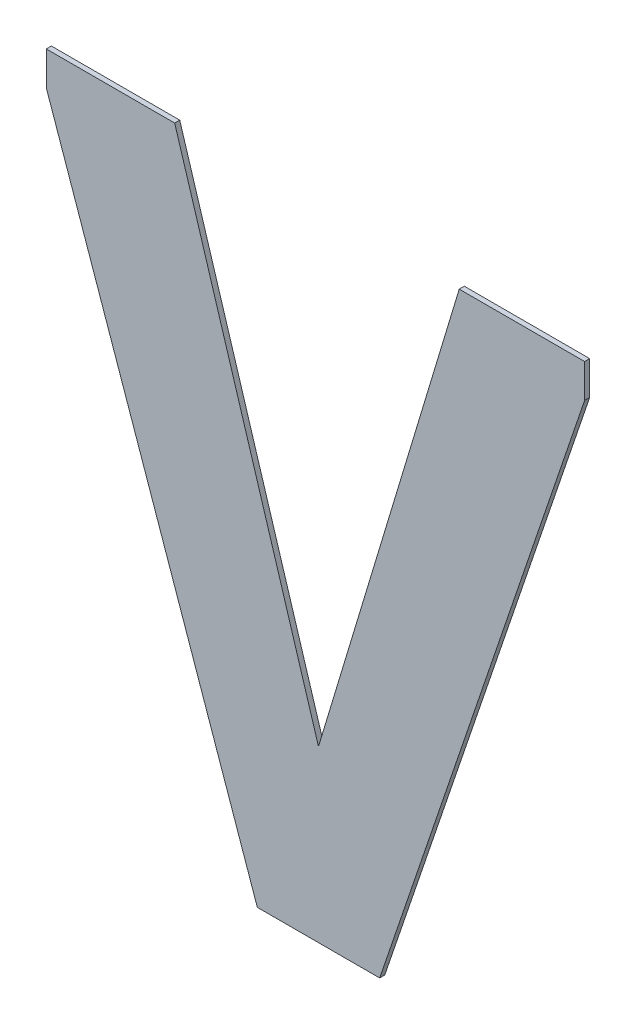
ISO-10303-21;
HEADER;
FILE_DESCRIPTION(('STEP AP214'),'2;1');
FILE_NAME('part.step','',(''),(''),'','','');
FILE_SCHEMA(('AUTOMOTIVE_DESIGN { 1 0 10303 214 1 1 1 1 }'));
ENDSEC;
DATA;
#1=APPLICATION_CONTEXT('core data for automotive mechanical design processes');
#2=APPLICATION_PROTOCOL_DEFINITION('international standard','automotive_design',2000,#1);
#3=PRODUCT_CONTEXT('',#1,'mechanical');
#4=PRODUCT('Part','Part','',(#3));
#5=PRODUCT_RELATED_PRODUCT_CATEGORY('part','',(#4));
#6=PRODUCT_DEFINITION_FORMATION('','',#4);
#7=PRODUCT_DEFINITION_CONTEXT('part definition',#1,'design');
#8=PRODUCT_DEFINITION('design','',#6,#7);
#9=PRODUCT_DEFINITION_SHAPE('','',#8);
#10=(LENGTH_UNIT() NAMED_UNIT(*) SI_UNIT(.MILLI.,.METRE.));
#11=(NAMED_UNIT(*) PLANE_ANGLE_UNIT() SI_UNIT($,.RADIAN.));
#12=(NAMED_UNIT(*) SI_UNIT($,.STERADIAN.) SOLID_ANGLE_UNIT());
#13=UNCERTAINTY_MEASURE_WITH_UNIT(LENGTH_MEASURE(1.E-05),#10,'distance_accuracy_value','');
#14=(GEOMETRIC_REPRESENTATION_CONTEXT(3) GLOBAL_UNCERTAINTY_ASSIGNED_CONTEXT((#13)) GLOBAL_UNIT_ASSIGNED_CONTEXT((#10,
#11,#12)) REPRESENTATION_CONTEXT('',''));
#15=CARTESIAN_POINT('',(0.,0.,0.));
#16=DIRECTION('',(0.,0.,1.));
#17=DIRECTION('',(1.,0.,0.));
#18=AXIS2_PLACEMENT_3D('',#15,#16,#17);
#19=CARTESIAN_POINT('',(-0.5146307591557,-0.1540642016862,0.00086146168299));
#20=DIRECTION('',(0.,-1.,0.));
#21=DIRECTION('',(0.,0.,-1.));
#22=AXIS2_PLACEMENT_3D('',#19,#20,#21);
#23=PLANE('',#22);
#24=DIRECTION('',(0.,0.,1.));
#25=VECTOR('',#24,1.);
#26=CARTESIAN_POINT('',(-0.5001531659177,-0.1540642016862,-0.00033853831701));
#27=LINE('',#26,#25);
#28=CARTESIAN_POINT('',(-0.5001531659177,-0.1540642016862,-0.00033853831701));
#29=VERTEX_POINT('',#28);
#30=CARTESIAN_POINT('',(-0.5001531659177,-0.1540642016862,0.00086146168299));
#31=VERTEX_POINT('',#30);
#32=EDGE_CURVE('E11',#29,#31,#27,.T.);
#33=ORIENTED_EDGE('',*,*,#32,.T.);
#34=DIRECTION('',(-1.,0.,0.));
#35=VECTOR('',#34,1.);
#36=CARTESIAN_POINT('',(-0.5001531659177,-0.1540642016862,0.00086146168299));
#37=LINE('',#36,#35);
#38=CARTESIAN_POINT('',(-0.5291083523937,-0.1540642016862,0.00086146168299));
#39=VERTEX_POINT('',#38);
#40=EDGE_CURVE('E24',#31,#39,#37,.T.);
#41=ORIENTED_EDGE('',*,*,#40,.T.);
#42=DIRECTION('',(0.,0.,1.));
#43=VECTOR('',#42,1.);
#44=CARTESIAN_POINT('',(-0.5291083523937,-0.1540642016862,-0.00033853831701));
#45=LINE('',#44,#43);
#46=CARTESIAN_POINT('',(-0.5291083523937,-0.1540642016862,-0.00033853831701));
#47=VERTEX_POINT('',#46);
#48=EDGE_CURVE('E155',#47,#39,#45,.T.);
#49=ORIENTED_EDGE('',*,*,#48,.F.);
#50=DIRECTION('',(-1.,0.,0.));
#51=VECTOR('',#50,1.);
#52=CARTESIAN_POINT('',(-0.5001531659177,-0.1540642016862,-0.00033853831701));
#53=LINE('',#52,#51);
#54=EDGE_CURVE('E153',#29,#47,#53,.T.);
#55=ORIENTED_EDGE('',*,*,#54,.F.);
#56=EDGE_LOOP('',(#33,#41,#49,#55));
#57=FACE_BOUND('',#56,.T.);
#58=ADVANCED_FACE('F17',(#57),#23,.T.);
#59=CARTESIAN_POINT('',(-0.5540721491029,-0.082584404006468,0.00086146168299));
#60=DIRECTION('',(-0.944081069949815,-0.32971341095323,0.));
#61=DIRECTION('',(0.,0.,1.));
#62=AXIS2_PLACEMENT_3D('',#59,#60,#61);
#63=PLANE('',#62);
#64=ORIENTED_EDGE('',*,*,#48,.T.);
#65=DIRECTION('',(-0.32971341095323,0.944081069949815,0.));
#66=VECTOR('',#65,1.);
#67=CARTESIAN_POINT('',(-0.5291083523937,-0.1540642016862,0.00086146168299));
#68=LINE('',#67,#66);
#69=CARTESIAN_POINT('',(-0.5790359458121,-0.011104606326736,0.00086146168299));
#70=VERTEX_POINT('',#69);
#71=EDGE_CURVE('E151',#39,#70,#68,.T.);
#72=ORIENTED_EDGE('',*,*,#71,.T.);
#73=DIRECTION('',(0.,0.,1.));
#74=VECTOR('',#73,1.);
#75=CARTESIAN_POINT('',(-0.5790359458121,-0.011104606326736,-0.00033853831701));
#76=LINE('',#75,#74);
#77=CARTESIAN_POINT('',(-0.5790359458121,-0.011104606326736,-0.00033853831701));
#78=VERTEX_POINT('',#77);
#79=EDGE_CURVE('E148',#78,#70,#76,.T.);
#80=ORIENTED_EDGE('',*,*,#79,.F.);
#81=DIRECTION('',(-0.32971341095323,0.944081069949815,0.));
#82=VECTOR('',#81,1.);
#83=CARTESIAN_POINT('',(-0.5291083523937,-0.1540642016862,-0.00033853831701));
#84=LINE('',#83,#82);
#85=EDGE_CURVE('E145',#47,#78,#84,.T.);
#86=ORIENTED_EDGE('',*,*,#85,.F.);
#87=EDGE_LOOP('',(#64,#72,#80,#86));
#88=FACE_BOUND('',#87,.T.);
#89=ADVANCED_FACE('F161',(#88),#63,.T.);
#90=CARTESIAN_POINT('',(-0.5790359458121,-0.00711827398195001,0.00086146168299));
#91=DIRECTION('',(-1.,0.,0.));
#92=DIRECTION('',(0.,0.,1.));
#93=AXIS2_PLACEMENT_3D('',#90,#91,#92);
#94=PLANE('',#93);
#95=ORIENTED_EDGE('',*,*,#79,.T.);
#96=DIRECTION('',(0.,1.,0.));
#97=VECTOR('',#96,1.);
#98=CARTESIAN_POINT('',(-0.5790359458121,-0.011104606326736,0.00086146168299));
#99=LINE('',#98,#97);
#100=CARTESIAN_POINT('',(-0.5790359458121,-0.00313194163716401,0.00086146168299));
#101=VERTEX_POINT('',#100);
#102=EDGE_CURVE('E143',#70,#101,#99,.T.);
#103=ORIENTED_EDGE('',*,*,#102,.T.);
#104=DIRECTION('',(0.,0.,1.));
#105=VECTOR('',#104,1.);
#106=CARTESIAN_POINT('',(-0.5790359458121,-0.00313194163716401,-0.00033853831701));
#107=LINE('',#106,#105);
#108=CARTESIAN_POINT('',(-0.5790359458121,-0.00313194163716401,-0.00033853831701));
#109=VERTEX_POINT('',#108);
#110=EDGE_CURVE('E140',#109,#101,#107,.T.);
#111=ORIENTED_EDGE('',*,*,#110,.F.);
#112=DIRECTION('',(0.,1.,0.));
#113=VECTOR('',#112,1.);
#114=CARTESIAN_POINT('',(-0.5790359458121,-0.011104606326736,-0.00033853831701));
#115=LINE('',#114,#113);
#116=EDGE_CURVE('E137',#78,#109,#115,.T.);
#117=ORIENTED_EDGE('',*,*,#116,.F.);
#118=EDGE_LOOP('',(#95,#103,#111,#117));
#119=FACE_BOUND('',#118,.T.);
#120=ADVANCED_FACE('F167',(#119),#94,.T.);
#121=CARTESIAN_POINT('',(-0.5638467010363,-0.00313194163716401,0.00086146168299));
#122=DIRECTION('',(0.,1.,0.));
#123=DIRECTION('',(0.,0.,1.));
#124=AXIS2_PLACEMENT_3D('',#121,#122,#123);
#125=PLANE('',#124);
#126=ORIENTED_EDGE('',*,*,#110,.T.);
#127=DIRECTION('',(1.,0.,0.));
#128=VECTOR('',#127,1.);
#129=CARTESIAN_POINT('',(-0.5790359458121,-0.00313194163716401,0.00086146168299));
#130=LINE('',#129,#128);
#131=CARTESIAN_POINT('',(-0.5486574562605,-0.00313194163716401,0.00086146168299));
#132=VERTEX_POINT('',#131);
#133=EDGE_CURVE('E135',#101,#132,#130,.T.);
#134=ORIENTED_EDGE('',*,*,#133,.T.);
#135=DIRECTION('',(0.,0.,1.));
#136=VECTOR('',#135,1.);
#137=CARTESIAN_POINT('',(-0.5486574562605,-0.00313194163716401,-0.00033853831701));
#138=LINE('',#137,#136);
#139=CARTESIAN_POINT('',(-0.5486574562605,-0.00313194163716401,-0.00033853831701));
#140=VERTEX_POINT('',#139);
#141=EDGE_CURVE('E132',#140,#132,#138,.T.);
#142=ORIENTED_EDGE('',*,*,#141,.F.);
#143=DIRECTION('',(1.,0.,0.));
#144=VECTOR('',#143,1.);
#145=CARTESIAN_POINT('',(-0.5790359458121,-0.00313194163716401,-0.00033853831701));
#146=LINE('',#145,#144);
#147=EDGE_CURVE('E129',#109,#140,#146,.T.);
#148=ORIENTED_EDGE('',*,*,#147,.F.);
#149=EDGE_LOOP('',(#126,#134,#142,#148));
#150=FACE_BOUND('',#149,.T.);
#151=ADVANCED_FACE('F171',(#150),#125,.T.);
#152=CARTESIAN_POINT('',(-0.5316439270859,-0.058505294919482,0.00086146168299));
#153=DIRECTION('',(0.955897450324787,0.293700637490916,0.));
#154=DIRECTION('',(0.,0.,-1.));
#155=AXIS2_PLACEMENT_3D('',#152,#153,#154);
#156=PLANE('',#155);
#157=ORIENTED_EDGE('',*,*,#141,.T.);
#158=DIRECTION('',(0.293700637490916,-0.955897450324787,0.));
#159=VECTOR('',#158,1.);
#160=CARTESIAN_POINT('',(-0.5486574562605,-0.00313194163716401,0.00086146168299));
#161=LINE('',#160,#159);
#162=CARTESIAN_POINT('',(-0.5146303979113,-0.1138786482018,0.00086146168299));
#163=VERTEX_POINT('',#162);
#164=EDGE_CURVE('E127',#132,#163,#161,.T.);
#165=ORIENTED_EDGE('',*,*,#164,.T.);
#166=DIRECTION('',(0.,0.,1.));
#167=VECTOR('',#166,1.);
#168=CARTESIAN_POINT('',(-0.5146303979113,-0.1138786482018,-0.00033853831701));
#169=LINE('',#168,#167);
#170=CARTESIAN_POINT('',(-0.5146303979113,-0.1138786482018,-0.00033853831701));
#171=VERTEX_POINT('',#170);
#172=EDGE_CURVE('E124',#171,#163,#169,.T.);
#173=ORIENTED_EDGE('',*,*,#172,.F.);
#174=DIRECTION('',(0.293700637490916,-0.955897450324787,0.));
#175=VECTOR('',#174,1.);
#176=CARTESIAN_POINT('',(-0.5486574562605,-0.00313194163716401,-0.00033853831701));
#177=LINE('',#176,#175);
#178=EDGE_CURVE('E121',#140,#171,#177,.T.);
#179=ORIENTED_EDGE('',*,*,#178,.F.);
#180=EDGE_LOOP('',(#157,#165,#173,#179));
#181=FACE_BOUND('',#180,.T.);
#182=ADVANCED_FACE('F175',(#181),#156,.T.);
#183=CARTESIAN_POINT('',(-0.4979813643719,-0.058688807092672,0.00086146168299));
#184=DIRECTION('',(-0.957385527935417,0.288813003342687,0.));
#185=DIRECTION('',(0.,0.,1.));
#186=AXIS2_PLACEMENT_3D('',#183,#184,#185);
#187=PLANE('',#186);
#188=ORIENTED_EDGE('',*,*,#172,.T.);
#189=DIRECTION('',(0.288813003342687,0.957385527935417,0.));
#190=VECTOR('',#189,1.);
#191=CARTESIAN_POINT('',(-0.5146303979113,-0.1138786482018,0.00086146168299));
#192=LINE('',#191,#190);
#193=CARTESIAN_POINT('',(-0.4813323308325,-0.00349896598354401,0.00086146168299));
#194=VERTEX_POINT('',#193);
#195=EDGE_CURVE('E119',#163,#194,#192,.T.);
#196=ORIENTED_EDGE('',*,*,#195,.T.);
#197=DIRECTION('',(0.,0.,1.));
#198=VECTOR('',#197,1.);
#199=CARTESIAN_POINT('',(-0.4813323308325,-0.00349896598354401,-0.00033853831701));
#200=LINE('',#199,#198);
#201=CARTESIAN_POINT('',(-0.4813323308325,-0.00349896598354401,-0.00033853831701));
#202=VERTEX_POINT('',#201);
#203=EDGE_CURVE('E116',#202,#194,#200,.T.);
#204=ORIENTED_EDGE('',*,*,#203,.F.);
#205=DIRECTION('',(0.288813003342687,0.957385527935417,0.));
#206=VECTOR('',#205,1.);
#207=CARTESIAN_POINT('',(-0.5146303979113,-0.1138786482018,-0.00033853831701));
#208=LINE('',#207,#206);
#209=EDGE_CURVE('E114',#171,#202,#208,.T.);
#210=ORIENTED_EDGE('',*,*,#209,.F.);
#211=EDGE_LOOP('',(#188,#196,#204,#210));
#212=FACE_BOUND('',#211,.T.);
#213=ADVANCED_FACE('F178',(#212),#187,.T.);
#214=CARTESIAN_POINT('',(-0.4664960218701,-0.00349896598354401,0.00086146168299));
#215=DIRECTION('',(0.,1.,0.));
#216=DIRECTION('',(0.,0.,1.));
#217=AXIS2_PLACEMENT_3D('',#214,#215,#216);
#218=PLANE('',#217);
#219=ORIENTED_EDGE('',*,*,#203,.T.);
#220=DIRECTION('',(1.,0.,0.));
#221=VECTOR('',#220,1.);
#222=CARTESIAN_POINT('',(-0.4813323308325,-0.00349896598354401,0.00086146168299));
#223=LINE('',#222,#221);
#224=CARTESIAN_POINT('',(-0.4516597129077,-0.00349896598354401,0.00086146168299));
#225=VERTEX_POINT('',#224);
#226=EDGE_CURVE('E112',#194,#225,#223,.T.);
#227=ORIENTED_EDGE('',*,*,#226,.T.);
#228=DIRECTION('',(0.,0.,1.));
#229=VECTOR('',#228,1.);
#230=CARTESIAN_POINT('',(-0.4516597129077,-0.00349896598354401,-0.00033853831701));
#231=LINE('',#230,#229);
#232=CARTESIAN_POINT('',(-0.4516597129077,-0.00349896598354401,-0.00033853831701));
#233=VERTEX_POINT('',#232);
#234=EDGE_CURVE('E110',#233,#225,#231,.T.);
#235=ORIENTED_EDGE('',*,*,#234,.F.);
#236=DIRECTION('',(1.,0.,0.));
#237=VECTOR('',#236,1.);
#238=CARTESIAN_POINT('',(-0.4813323308325,-0.00349896598354401,-0.00033853831701));
#239=LINE('',#238,#237);
#240=EDGE_CURVE('E101',#202,#233,#239,.T.);
#241=ORIENTED_EDGE('',*,*,#240,.F.);
#242=EDGE_LOOP('',(#219,#227,#235,#241));
#243=FACE_BOUND('',#242,.T.);
#244=ADVANCED_FACE('F181',(#243),#218,.T.);
#245=CARTESIAN_POINT('',(-0.4516597129077,-0.00747843468405801,0.00086146168299));
#246=DIRECTION('',(1.,0.,0.));
#247=DIRECTION('',(0.,0.,-1.));
#248=AXIS2_PLACEMENT_3D('',#245,#246,#247);
#249=PLANE('',#248);
#250=ORIENTED_EDGE('',*,*,#234,.T.);
#251=DIRECTION('',(0.,-1.,0.));
#252=VECTOR('',#251,1.);
#253=CARTESIAN_POINT('',(-0.4516597129077,-0.00349896598354401,0.00086146168299));
#254=LINE('',#253,#252);
#255=CARTESIAN_POINT('',(-0.4516597129077,-0.011457903384572,0.00086146168299));
#256=VERTEX_POINT('',#255);
#257=EDGE_CURVE('E90',#225,#256,#254,.T.);
#258=ORIENTED_EDGE('',*,*,#257,.T.);
#259=DIRECTION('',(0.,0.,1.));
#260=VECTOR('',#259,1.);
#261=CARTESIAN_POINT('',(-0.4516597129077,-0.011457903384572,-0.00033853831701));
#262=LINE('',#261,#260);
#263=CARTESIAN_POINT('',(-0.4516597129077,-0.011457903384572,-0.00033853831701));
#264=VERTEX_POINT('',#263);
#265=EDGE_CURVE('E84',#264,#256,#262,.T.);
#266=ORIENTED_EDGE('',*,*,#265,.F.);
#267=DIRECTION('',(0.,-1.,0.));
#268=VECTOR('',#267,1.);
#269=CARTESIAN_POINT('',(-0.4516597129077,-0.00349896598354401,-0.00033853831701));
#270=LINE('',#269,#268);
#271=EDGE_CURVE('E88',#233,#264,#270,.T.);
#272=ORIENTED_EDGE('',*,*,#271,.F.);
#273=EDGE_LOOP('',(#250,#258,#266,#272));
#274=FACE_BOUND('',#273,.T.);
#275=ADVANCED_FACE('F87',(#274),#249,.T.);
#276=CARTESIAN_POINT('',(-0.4759064394127,-0.082761052535386,0.00086146168299));
#277=DIRECTION('',(0.946757949931284,-0.321946244335777,0.));
#278=DIRECTION('',(0.,0.,-1.));
#279=AXIS2_PLACEMENT_3D('',#276,#277,#278);
#280=PLANE('',#279);
#281=ORIENTED_EDGE('',*,*,#265,.T.);
#282=DIRECTION('',(-0.321946244335777,-0.946757949931284,0.));
#283=VECTOR('',#282,1.);
#284=CARTESIAN_POINT('',(-0.4516597129077,-0.011457903384572,0.00086146168299));
#285=LINE('',#284,#283);
#286=EDGE_CURVE('E102',#256,#31,#285,.T.);
#287=ORIENTED_EDGE('',*,*,#286,.T.);
#288=ORIENTED_EDGE('',*,*,#32,.F.);
#289=DIRECTION('',(-0.321946244335777,-0.946757949931284,0.));
#290=VECTOR('',#289,1.);
#291=CARTESIAN_POINT('',(-0.4516597129077,-0.011457903384572,-0.00033853831701));
#292=LINE('',#291,#290);
#293=EDGE_CURVE('E98',#264,#29,#292,.T.);
#294=ORIENTED_EDGE('',*,*,#293,.F.);
#295=EDGE_LOOP('',(#281,#287,#288,#294));
#296=FACE_BOUND('',#295,.T.);
#297=ADVANCED_FACE('F104',(#296),#280,.T.);
#298=CARTESIAN_POINT('',(-0.5153478293599,-0.1540642016862,-0.00033853831701));
#299=DIRECTION('',(0.,0.,1.));
#300=DIRECTION('',(1.,0.,0.));
#301=AXIS2_PLACEMENT_3D('',#298,#299,#300);
#302=PLANE('',#301);
#303=ORIENTED_EDGE('',*,*,#54,.T.);
#304=ORIENTED_EDGE('',*,*,#85,.T.);
#305=ORIENTED_EDGE('',*,*,#116,.T.);
#306=ORIENTED_EDGE('',*,*,#147,.T.);
#307=ORIENTED_EDGE('',*,*,#178,.T.);
#308=ORIENTED_EDGE('',*,*,#209,.T.);
#309=ORIENTED_EDGE('',*,*,#240,.T.);
#310=ORIENTED_EDGE('',*,*,#271,.T.);
#311=ORIENTED_EDGE('',*,*,#293,.T.);
#312=EDGE_LOOP('',(#303,#304,#305,#306,#307,#308,#309,#310,#311));
#313=FACE_BOUND('',#312,.T.);
#314=ADVANCED_FACE('F97',(#313),#302,.F.);
#315=CARTESIAN_POINT('',(-0.5153478293599,-0.1540642016862,0.00086146168299));
#316=DIRECTION('',(0.,0.,1.));
#317=DIRECTION('',(1.,0.,0.));
#318=AXIS2_PLACEMENT_3D('',#315,#316,#317);
#319=PLANE('',#318);
#320=ORIENTED_EDGE('',*,*,#40,.F.);
#321=ORIENTED_EDGE('',*,*,#286,.F.);
#322=ORIENTED_EDGE('',*,*,#257,.F.);
#323=ORIENTED_EDGE('',*,*,#226,.F.);
#324=ORIENTED_EDGE('',*,*,#195,.F.);
#325=ORIENTED_EDGE('',*,*,#164,.F.);
#326=ORIENTED_EDGE('',*,*,#133,.F.);
#327=ORIENTED_EDGE('',*,*,#102,.F.);
#328=ORIENTED_EDGE('',*,*,#71,.F.);
#329=EDGE_LOOP('',(#320,#321,#322,#323,#324,#325,#326,#327,#328));
#330=FACE_BOUND('',#329,.T.);
#331=ADVANCED_FACE('F163',(#330),#319,.T.);
#332=CLOSED_SHELL('',(#58,#89,#120,#151,#182,#213,#244,#275,#297,#314,#331));
#333=MANIFOLD_SOLID_BREP('B1',#332);
#334=ADVANCED_BREP_SHAPE_REPRESENTATION('',(#18,#333),#14);
#335=SHAPE_DEFINITION_REPRESENTATION(#9,#334);
ENDSEC;
END-ISO-10303-21;
